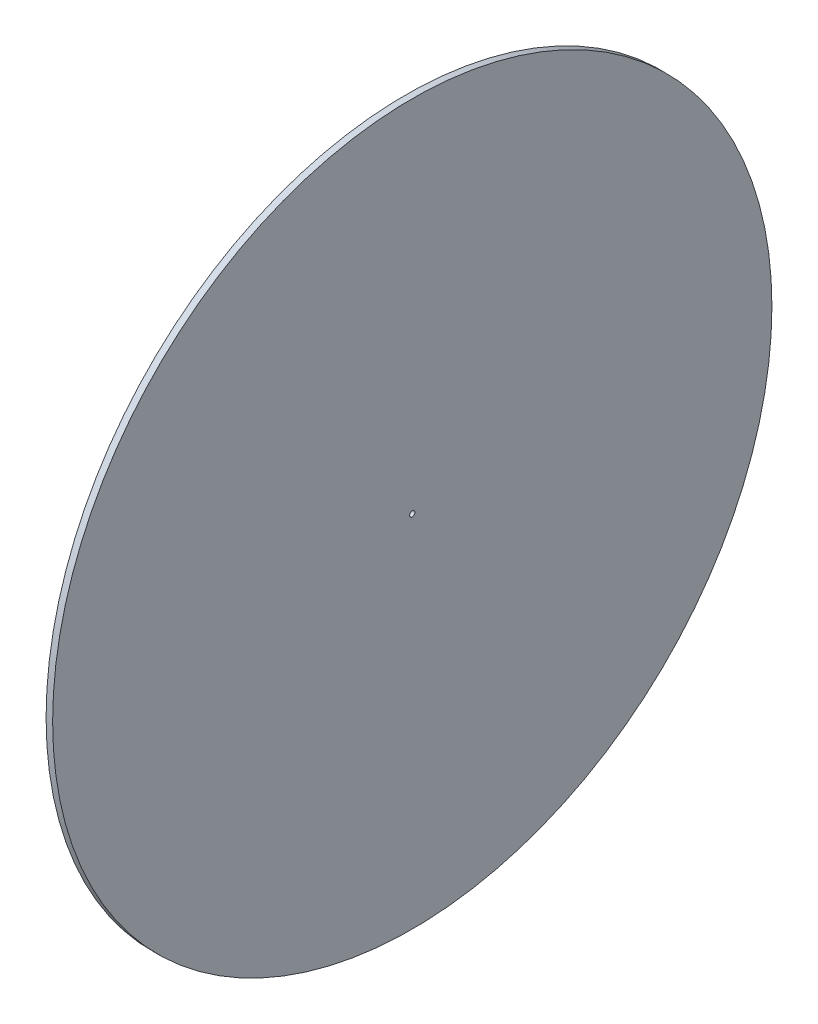
ISO-10303-21;
HEADER;
FILE_DESCRIPTION(('STEP AP214'),'2;1');
FILE_NAME('part.step','',(''),(''),'','','');
FILE_SCHEMA(('AUTOMOTIVE_DESIGN { 1 0 10303 214 1 1 1 1 }'));
ENDSEC;
DATA;
#1=APPLICATION_CONTEXT('core data for automotive mechanical design processes');
#2=APPLICATION_PROTOCOL_DEFINITION('international standard','automotive_design',2000,#1);
#3=PRODUCT_CONTEXT('',#1,'mechanical');
#4=PRODUCT('Part','Part','',(#3));
#5=PRODUCT_RELATED_PRODUCT_CATEGORY('part','',(#4));
#6=PRODUCT_DEFINITION_FORMATION('','',#4);
#7=PRODUCT_DEFINITION_CONTEXT('part definition',#1,'design');
#8=PRODUCT_DEFINITION('design','',#6,#7);
#9=PRODUCT_DEFINITION_SHAPE('','',#8);
#10=(LENGTH_UNIT() NAMED_UNIT(*) SI_UNIT(.MILLI.,.METRE.));
#11=(NAMED_UNIT(*) PLANE_ANGLE_UNIT() SI_UNIT($,.RADIAN.));
#12=(NAMED_UNIT(*) SI_UNIT($,.STERADIAN.) SOLID_ANGLE_UNIT());
#13=UNCERTAINTY_MEASURE_WITH_UNIT(LENGTH_MEASURE(1.E-05),#10,'distance_accuracy_value','');
#14=(GEOMETRIC_REPRESENTATION_CONTEXT(3) GLOBAL_UNCERTAINTY_ASSIGNED_CONTEXT((#13)) GLOBAL_UNIT_ASSIGNED_CONTEXT((#10,
#11,#12)) REPRESENTATION_CONTEXT('',''));
#15=CARTESIAN_POINT('',(0.,0.,0.));
#16=DIRECTION('',(0.,0.,1.));
#17=DIRECTION('',(1.,0.,0.));
#18=AXIS2_PLACEMENT_3D('',#15,#16,#17);
#19=CARTESIAN_POINT('',(3.,0.,0.));
#20=DIRECTION('',(-1.,0.,0.));
#21=DIRECTION('',(0.,0.,1.));
#22=AXIS2_PLACEMENT_3D('',#19,#20,#21);
#23=CYLINDRICAL_SURFACE('',#22,165.);
#24=CARTESIAN_POINT('',(3.,0.,0.));
#25=DIRECTION('',(1.,0.,0.));
#26=DIRECTION('',(0.,0.,-1.));
#27=AXIS2_PLACEMENT_3D('',#24,#25,#26);
#28=CIRCLE('',#27,165.);
#29=CARTESIAN_POINT('',(3.,0.,-165.));
#30=VERTEX_POINT('',#29);
#31=EDGE_CURVE('E10',#30,#30,#28,.T.);
#32=ORIENTED_EDGE('',*,*,#31,.F.);
#33=EDGE_LOOP('',(#32));
#34=FACE_BOUND('',#33,.T.);
#35=CARTESIAN_POINT('',(0.,0.,0.));
#36=DIRECTION('',(1.,0.,0.));
#37=DIRECTION('',(0.,0.,-1.));
#38=AXIS2_PLACEMENT_3D('',#35,#36,#37);
#39=CIRCLE('',#38,165.);
#40=CARTESIAN_POINT('',(0.,0.,-165.));
#41=VERTEX_POINT('',#40);
#42=EDGE_CURVE('E38',#41,#41,#39,.T.);
#43=ORIENTED_EDGE('',*,*,#42,.T.);
#44=EDGE_LOOP('',(#43));
#45=FACE_BOUND('',#44,.T.);
#46=ADVANCED_FACE('F31',(#34,#45),#23,.T.);
#47=CARTESIAN_POINT('',(3.,0.,0.));
#48=DIRECTION('',(1.,0.,0.));
#49=DIRECTION('',(0.,0.,-1.));
#50=AXIS2_PLACEMENT_3D('',#47,#48,#49);
#51=PLANE('',#50);
#52=CARTESIAN_POINT('',(3.,0.,0.));
#53=DIRECTION('',(1.,0.,0.));
#54=DIRECTION('',(0.,0.,-1.));
#55=AXIS2_PLACEMENT_3D('',#52,#53,#54);
#56=CIRCLE('',#55,1.2);
#57=CARTESIAN_POINT('',(3.,0.,-1.2));
#58=VERTEX_POINT('',#57);
#59=EDGE_CURVE('E44',#58,#58,#56,.T.);
#60=ORIENTED_EDGE('',*,*,#59,.F.);
#61=EDGE_LOOP('',(#60));
#62=FACE_BOUND('',#61,.T.);
#63=ORIENTED_EDGE('',*,*,#31,.T.);
#64=EDGE_LOOP('',(#63));
#65=FACE_BOUND('',#64,.T.);
#66=ADVANCED_FACE('F60',(#62,#65),#51,.T.);
#67=CARTESIAN_POINT('',(0.,0.,0.));
#68=DIRECTION('',(1.,0.,0.));
#69=DIRECTION('',(0.,0.,-1.));
#70=AXIS2_PLACEMENT_3D('',#67,#68,#69);
#71=PLANE('',#70);
#72=CARTESIAN_POINT('',(0.,0.,0.));
#73=DIRECTION('',(1.,0.,0.));
#74=DIRECTION('',(0.,0.,-1.));
#75=AXIS2_PLACEMENT_3D('',#72,#73,#74);
#76=CIRCLE('',#75,1.2);
#77=CARTESIAN_POINT('',(0.,0.,-1.2));
#78=VERTEX_POINT('',#77);
#79=EDGE_CURVE('E34',#78,#78,#76,.T.);
#80=ORIENTED_EDGE('',*,*,#79,.T.);
#81=EDGE_LOOP('',(#80));
#82=FACE_BOUND('',#81,.T.);
#83=ORIENTED_EDGE('',*,*,#42,.F.);
#84=EDGE_LOOP('',(#83));
#85=FACE_BOUND('',#84,.T.);
#86=ADVANCED_FACE('F51',(#82,#85),#71,.F.);
#87=CARTESIAN_POINT('',(-7.,0.,0.));
#88=DIRECTION('',(1.,0.,0.));
#89=DIRECTION('',(0.,0.,-1.));
#90=AXIS2_PLACEMENT_3D('',#87,#88,#89);
#91=CYLINDRICAL_SURFACE('',#90,1.2);
#92=ORIENTED_EDGE('',*,*,#59,.T.);
#93=EDGE_LOOP('',(#92));
#94=FACE_BOUND('',#93,.T.);
#95=ORIENTED_EDGE('',*,*,#79,.F.);
#96=EDGE_LOOP('',(#95));
#97=FACE_BOUND('',#96,.T.);
#98=ADVANCED_FACE('F54',(#94,#97),#91,.F.);
#99=CLOSED_SHELL('',(#46,#66,#86,#98));
#100=MANIFOLD_SOLID_BREP('B2',#99);
#101=ADVANCED_BREP_SHAPE_REPRESENTATION('',(#18,#100),#14);
#102=SHAPE_DEFINITION_REPRESENTATION(#9,#101);
ENDSEC;
END-ISO-10303-21;
